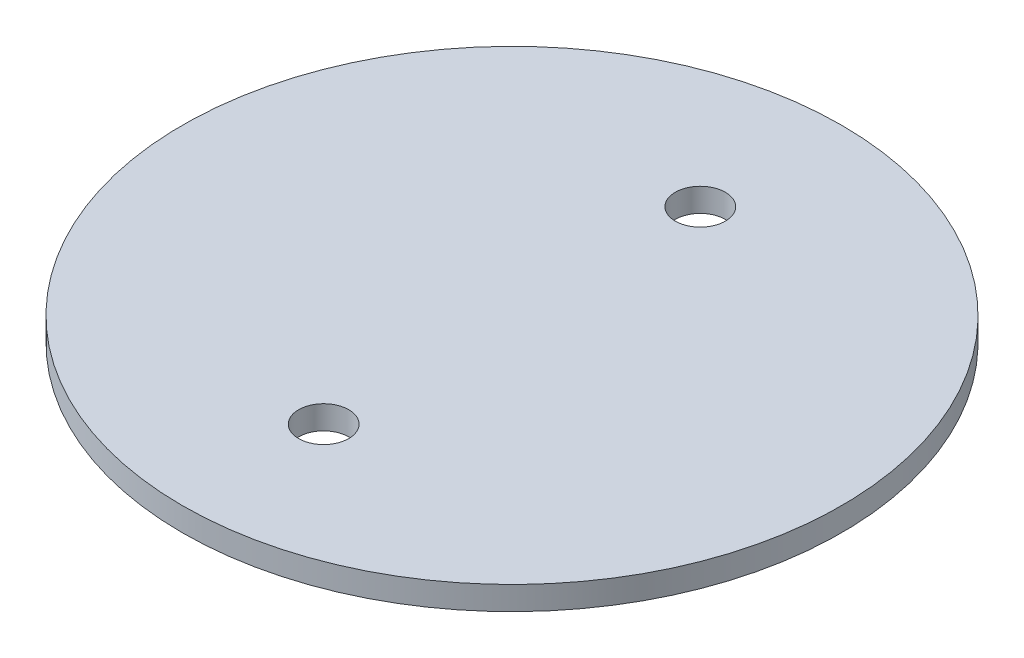
ISO-10303-21;
HEADER;
FILE_DESCRIPTION(('STEP AP214'),'2;1');
FILE_NAME('part.step','',(''),(''),'','','');
FILE_SCHEMA(('AUTOMOTIVE_DESIGN { 1 0 10303 214 1 1 1 1 }'));
ENDSEC;
DATA;
#1=APPLICATION_CONTEXT('core data for automotive mechanical design processes');
#2=APPLICATION_PROTOCOL_DEFINITION('international standard','automotive_design',2000,#1);
#3=PRODUCT_CONTEXT('',#1,'mechanical');
#4=PRODUCT('Part','Part','',(#3));
#5=PRODUCT_RELATED_PRODUCT_CATEGORY('part','',(#4));
#6=PRODUCT_DEFINITION_FORMATION('','',#4);
#7=PRODUCT_DEFINITION_CONTEXT('part definition',#1,'design');
#8=PRODUCT_DEFINITION('design','',#6,#7);
#9=PRODUCT_DEFINITION_SHAPE('','',#8);
#10=(LENGTH_UNIT() NAMED_UNIT(*) SI_UNIT(.MILLI.,.METRE.));
#11=(NAMED_UNIT(*) PLANE_ANGLE_UNIT() SI_UNIT($,.RADIAN.));
#12=(NAMED_UNIT(*) SI_UNIT($,.STERADIAN.) SOLID_ANGLE_UNIT());
#13=UNCERTAINTY_MEASURE_WITH_UNIT(LENGTH_MEASURE(1.E-05),#10,'distance_accuracy_value','');
#14=(GEOMETRIC_REPRESENTATION_CONTEXT(3) GLOBAL_UNCERTAINTY_ASSIGNED_CONTEXT((#13)) GLOBAL_UNIT_ASSIGNED_CONTEXT((#10,
#11,#12)) REPRESENTATION_CONTEXT('',''));
#15=CARTESIAN_POINT('',(0.,0.,0.));
#16=DIRECTION('',(0.,0.,1.));
#17=DIRECTION('',(1.,0.,0.));
#18=AXIS2_PLACEMENT_3D('',#15,#16,#17);
#19=CARTESIAN_POINT('',(0.,1.5875,0.));
#20=DIRECTION('',(0.,-1.,0.));
#21=DIRECTION('',(0.,0.,-1.));
#22=AXIS2_PLACEMENT_3D('',#19,#20,#21);
#23=CYLINDRICAL_SURFACE('',#22,44.45);
#24=CARTESIAN_POINT('',(0.,1.5875,0.));
#25=DIRECTION('',(0.,1.,0.));
#26=DIRECTION('',(0.,0.,1.));
#27=AXIS2_PLACEMENT_3D('',#24,#25,#26);
#28=CIRCLE('',#27,44.45);
#29=CARTESIAN_POINT('',(0.,1.5875,44.45));
#30=VERTEX_POINT('',#29);
#31=EDGE_CURVE('E10',#30,#30,#28,.T.);
#32=ORIENTED_EDGE('',*,*,#31,.F.);
#33=EDGE_LOOP('',(#32));
#34=FACE_BOUND('',#33,.T.);
#35=CARTESIAN_POINT('',(0.,-1.5875,0.));
#36=DIRECTION('',(0.,1.,0.));
#37=DIRECTION('',(0.,0.,1.));
#38=AXIS2_PLACEMENT_3D('',#35,#36,#37);
#39=CIRCLE('',#38,44.45);
#40=CARTESIAN_POINT('',(0.,-1.5875,44.45));
#41=VERTEX_POINT('',#40);
#42=EDGE_CURVE('E46',#41,#41,#39,.T.);
#43=ORIENTED_EDGE('',*,*,#42,.T.);
#44=EDGE_LOOP('',(#43));
#45=FACE_BOUND('',#44,.T.);
#46=ADVANCED_FACE('F43',(#34,#45),#23,.T.);
#47=CARTESIAN_POINT('',(0.,1.5875,0.));
#48=DIRECTION('',(0.,1.,0.));
#49=DIRECTION('',(0.,0.,1.));
#50=AXIS2_PLACEMENT_3D('',#47,#48,#49);
#51=PLANE('',#50);
#52=CARTESIAN_POINT('',(0.,1.5875,-25.4));
#53=DIRECTION('',(0.,1.,0.));
#54=DIRECTION('',(0.,0.,1.));
#55=AXIS2_PLACEMENT_3D('',#52,#53,#54);
#56=CIRCLE('',#55,3.37819999999999);
#57=CARTESIAN_POINT('',(0.,1.5875,-22.0218));
#58=VERTEX_POINT('',#57);
#59=EDGE_CURVE('E68',#58,#58,#56,.T.);
#60=ORIENTED_EDGE('',*,*,#59,.F.);
#61=EDGE_LOOP('',(#60));
#62=FACE_BOUND('',#61,.T.);
#63=CARTESIAN_POINT('',(0.,1.5875,25.4));
#64=DIRECTION('',(0.,1.,0.));
#65=DIRECTION('',(0.,0.,1.));
#66=AXIS2_PLACEMENT_3D('',#63,#64,#65);
#67=CIRCLE('',#66,3.37819999999999);
#68=CARTESIAN_POINT('',(0.,1.5875,28.7782));
#69=VERTEX_POINT('',#68);
#70=EDGE_CURVE('E60',#69,#69,#67,.T.);
#71=ORIENTED_EDGE('',*,*,#70,.F.);
#72=EDGE_LOOP('',(#71));
#73=FACE_BOUND('',#72,.T.);
#74=ORIENTED_EDGE('',*,*,#31,.T.);
#75=EDGE_LOOP('',(#74));
#76=FACE_BOUND('',#75,.T.);
#77=ADVANCED_FACE('F75',(#62,#73,#76),#51,.T.);
#78=CARTESIAN_POINT('',(0.,-1.5875,0.));
#79=DIRECTION('',(0.,1.,0.));
#80=DIRECTION('',(0.,0.,1.));
#81=AXIS2_PLACEMENT_3D('',#78,#79,#80);
#82=PLANE('',#81);
#83=CARTESIAN_POINT('',(0.,-1.5875,-25.4));
#84=DIRECTION('',(0.,1.,0.));
#85=DIRECTION('',(0.,0.,1.));
#86=AXIS2_PLACEMENT_3D('',#83,#84,#85);
#87=CIRCLE('',#86,3.37819999999999);
#88=CARTESIAN_POINT('',(0.,-1.5875,-22.0218));
#89=VERTEX_POINT('',#88);
#90=EDGE_CURVE('E64',#89,#89,#87,.T.);
#91=ORIENTED_EDGE('',*,*,#90,.T.);
#92=EDGE_LOOP('',(#91));
#93=FACE_BOUND('',#92,.T.);
#94=CARTESIAN_POINT('',(0.,-1.5875,25.4));
#95=DIRECTION('',(0.,1.,0.));
#96=DIRECTION('',(0.,0.,1.));
#97=AXIS2_PLACEMENT_3D('',#94,#95,#96);
#98=CIRCLE('',#97,3.37819999999999);
#99=CARTESIAN_POINT('',(0.,-1.5875,28.7782));
#100=VERTEX_POINT('',#99);
#101=EDGE_CURVE('E55',#100,#100,#98,.T.);
#102=ORIENTED_EDGE('',*,*,#101,.T.);
#103=EDGE_LOOP('',(#102));
#104=FACE_BOUND('',#103,.T.);
#105=ORIENTED_EDGE('',*,*,#42,.F.);
#106=EDGE_LOOP('',(#105));
#107=FACE_BOUND('',#106,.T.);
#108=ADVANCED_FACE('F78',(#93,#104,#107),#82,.F.);
#109=CARTESIAN_POINT('',(0.,1.5875,25.4));
#110=DIRECTION('',(0.,1.,0.));
#111=DIRECTION('',(0.,0.,1.));
#112=AXIS2_PLACEMENT_3D('',#109,#110,#111);
#113=CYLINDRICAL_SURFACE('',#112,3.37819999999999);
#114=ORIENTED_EDGE('',*,*,#101,.F.);
#115=EDGE_LOOP('',(#114));
#116=FACE_BOUND('',#115,.T.);
#117=ORIENTED_EDGE('',*,*,#70,.T.);
#118=EDGE_LOOP('',(#117));
#119=FACE_BOUND('',#118,.T.);
#120=ADVANCED_FACE('F82',(#116,#119),#113,.F.);
#121=CARTESIAN_POINT('',(0.,1.5875,-25.4));
#122=DIRECTION('',(0.,1.,0.));
#123=DIRECTION('',(0.,0.,1.));
#124=AXIS2_PLACEMENT_3D('',#121,#122,#123);
#125=CYLINDRICAL_SURFACE('',#124,3.37819999999999);
#126=ORIENTED_EDGE('',*,*,#90,.F.);
#127=EDGE_LOOP('',(#126));
#128=FACE_BOUND('',#127,.T.);
#129=ORIENTED_EDGE('',*,*,#59,.T.);
#130=EDGE_LOOP('',(#129));
#131=FACE_BOUND('',#130,.T.);
#132=ADVANCED_FACE('F73',(#128,#131),#125,.F.);
#133=CLOSED_SHELL('',(#46,#77,#108,#120,#132));
#134=MANIFOLD_SOLID_BREP('B2',#133);
#135=ADVANCED_BREP_SHAPE_REPRESENTATION('',(#18,#134),#14);
#136=SHAPE_DEFINITION_REPRESENTATION(#9,#135);
ENDSEC;
END-ISO-10303-21;
